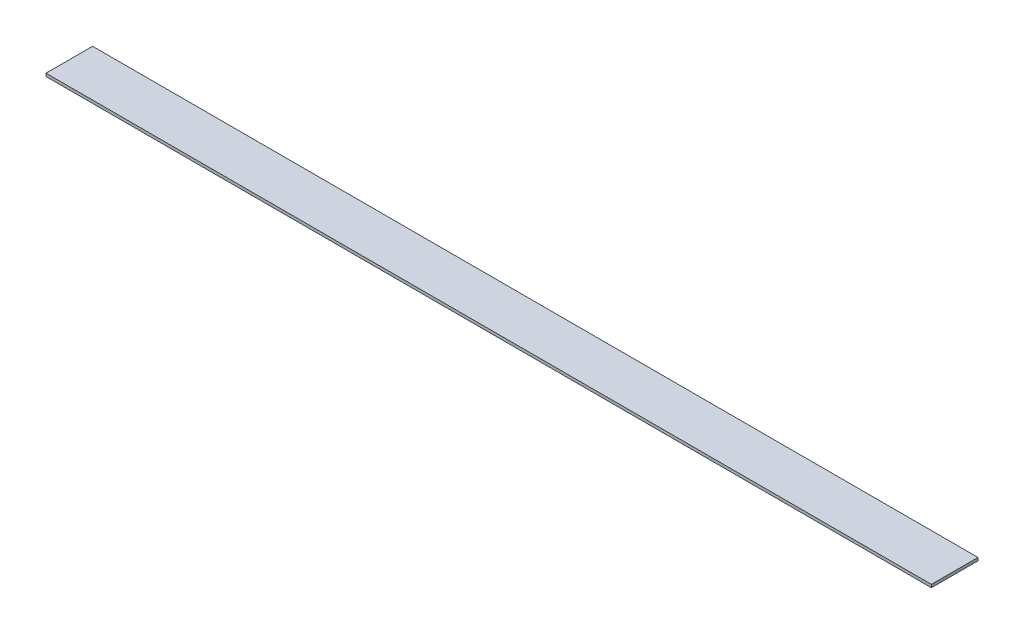
ISO-10303-21;
HEADER;
FILE_DESCRIPTION(('STEP AP214'),'2;1');
FILE_NAME('part.step','',(''),(''),'','','');
FILE_SCHEMA(('AUTOMOTIVE_DESIGN { 1 0 10303 214 1 1 1 1 }'));
ENDSEC;
DATA;
#1=APPLICATION_CONTEXT('core data for automotive mechanical design processes');
#2=APPLICATION_PROTOCOL_DEFINITION('international standard','automotive_design',2000,#1);
#3=PRODUCT_CONTEXT('',#1,'mechanical');
#4=PRODUCT('Part','Part','',(#3));
#5=PRODUCT_RELATED_PRODUCT_CATEGORY('part','',(#4));
#6=PRODUCT_DEFINITION_FORMATION('','',#4);
#7=PRODUCT_DEFINITION_CONTEXT('part definition',#1,'design');
#8=PRODUCT_DEFINITION('design','',#6,#7);
#9=PRODUCT_DEFINITION_SHAPE('','',#8);
#10=(LENGTH_UNIT() NAMED_UNIT(*) SI_UNIT(.MILLI.,.METRE.));
#11=(NAMED_UNIT(*) PLANE_ANGLE_UNIT() SI_UNIT($,.RADIAN.));
#12=(NAMED_UNIT(*) SI_UNIT($,.STERADIAN.) SOLID_ANGLE_UNIT());
#13=UNCERTAINTY_MEASURE_WITH_UNIT(LENGTH_MEASURE(1.E-05),#10,'distance_accuracy_value','');
#14=(GEOMETRIC_REPRESENTATION_CONTEXT(3) GLOBAL_UNCERTAINTY_ASSIGNED_CONTEXT((#13)) GLOBAL_UNIT_ASSIGNED_CONTEXT((#10,
#11,#12)) REPRESENTATION_CONTEXT('',''));
#15=CARTESIAN_POINT('',(0.,0.,0.));
#16=DIRECTION('',(0.,0.,1.));
#17=DIRECTION('',(1.,0.,0.));
#18=AXIS2_PLACEMENT_3D('',#15,#16,#17);
#19=CARTESIAN_POINT('',(0.,1.5875,0.));
#20=DIRECTION('',(1.,0.,0.));
#21=DIRECTION('',(0.,0.,-1.));
#22=AXIS2_PLACEMENT_3D('',#19,#20,#21);
#23=PLANE('',#22);
#24=DIRECTION('',(0.,0.,1.));
#25=VECTOR('',#24,1.);
#26=CARTESIAN_POINT('',(0.,0.,0.));
#27=LINE('',#26,#25);
#28=CARTESIAN_POINT('',(0.,0.,-25.4));
#29=VERTEX_POINT('',#28);
#30=CARTESIAN_POINT('',(0.,0.,0.));
#31=VERTEX_POINT('',#30);
#32=EDGE_CURVE('E96',#29,#31,#27,.T.);
#33=ORIENTED_EDGE('',*,*,#32,.T.);
#34=DIRECTION('',(0.,-1.,0.));
#35=VECTOR('',#34,1.);
#36=CARTESIAN_POINT('',(0.,1.5875,0.));
#37=LINE('',#36,#35);
#38=CARTESIAN_POINT('',(0.,1.5875,0.));
#39=VERTEX_POINT('',#38);
#40=EDGE_CURVE('E11',#39,#31,#37,.T.);
#41=ORIENTED_EDGE('',*,*,#40,.F.);
#42=DIRECTION('',(0.,0.,1.));
#43=VECTOR('',#42,1.);
#44=CARTESIAN_POINT('',(0.,1.5875,0.));
#45=LINE('',#44,#43);
#46=CARTESIAN_POINT('',(0.,1.5875,-25.4));
#47=VERTEX_POINT('',#46);
#48=EDGE_CURVE('E84',#47,#39,#45,.T.);
#49=ORIENTED_EDGE('',*,*,#48,.F.);
#50=DIRECTION('',(0.,-1.,0.));
#51=VECTOR('',#50,1.);
#52=CARTESIAN_POINT('',(0.,1.5875,-25.4));
#53=LINE('',#52,#51);
#54=EDGE_CURVE('E92',#47,#29,#53,.T.);
#55=ORIENTED_EDGE('',*,*,#54,.T.);
#56=EDGE_LOOP('',(#33,#41,#49,#55));
#57=FACE_BOUND('',#56,.T.);
#58=ADVANCED_FACE('F33',(#57),#23,.F.);
#59=CARTESIAN_POINT('',(0.,1.5875,0.));
#60=DIRECTION('',(0.,0.,-1.));
#61=DIRECTION('',(-1.,0.,0.));
#62=AXIS2_PLACEMENT_3D('',#59,#60,#61);
#63=PLANE('',#62);
#64=DIRECTION('',(1.,0.,0.));
#65=VECTOR('',#64,1.);
#66=CARTESIAN_POINT('',(0.,0.,0.));
#67=LINE('',#66,#65);
#68=CARTESIAN_POINT('',(482.6,0.,0.));
#69=VERTEX_POINT('',#68);
#70=EDGE_CURVE('E88',#31,#69,#67,.T.);
#71=ORIENTED_EDGE('',*,*,#70,.T.);
#72=DIRECTION('',(0.,-1.,0.));
#73=VECTOR('',#72,1.);
#74=CARTESIAN_POINT('',(482.6,1.5875,0.));
#75=LINE('',#74,#73);
#76=CARTESIAN_POINT('',(482.6,1.5875,0.));
#77=VERTEX_POINT('',#76);
#78=EDGE_CURVE('E41',#77,#69,#75,.T.);
#79=ORIENTED_EDGE('',*,*,#78,.F.);
#80=DIRECTION('',(1.,0.,0.));
#81=VECTOR('',#80,1.);
#82=CARTESIAN_POINT('',(0.,1.5875,0.));
#83=LINE('',#82,#81);
#84=EDGE_CURVE('E79',#39,#77,#83,.T.);
#85=ORIENTED_EDGE('',*,*,#84,.F.);
#86=ORIENTED_EDGE('',*,*,#40,.T.);
#87=EDGE_LOOP('',(#71,#79,#85,#86));
#88=FACE_BOUND('',#87,.T.);
#89=ADVANCED_FACE('F87',(#88),#63,.F.);
#90=CARTESIAN_POINT('',(482.6,1.5875,0.));
#91=DIRECTION('',(-1.,0.,0.));
#92=DIRECTION('',(0.,0.,1.));
#93=AXIS2_PLACEMENT_3D('',#90,#91,#92);
#94=PLANE('',#93);
#95=DIRECTION('',(0.,0.,-1.));
#96=VECTOR('',#95,1.);
#97=CARTESIAN_POINT('',(482.6,0.,0.));
#98=LINE('',#97,#96);
#99=CARTESIAN_POINT('',(482.6,0.,-25.4));
#100=VERTEX_POINT('',#99);
#101=EDGE_CURVE('E66',#69,#100,#98,.T.);
#102=ORIENTED_EDGE('',*,*,#101,.T.);
#103=DIRECTION('',(0.,-1.,0.));
#104=VECTOR('',#103,1.);
#105=CARTESIAN_POINT('',(482.6,1.5875,-25.4));
#106=LINE('',#105,#104);
#107=CARTESIAN_POINT('',(482.6,1.5875,-25.4));
#108=VERTEX_POINT('',#107);
#109=EDGE_CURVE('E89',#108,#100,#106,.T.);
#110=ORIENTED_EDGE('',*,*,#109,.F.);
#111=DIRECTION('',(0.,0.,-1.));
#112=VECTOR('',#111,1.);
#113=CARTESIAN_POINT('',(482.6,1.5875,0.));
#114=LINE('',#113,#112);
#115=EDGE_CURVE('E82',#77,#108,#114,.T.);
#116=ORIENTED_EDGE('',*,*,#115,.F.);
#117=ORIENTED_EDGE('',*,*,#78,.T.);
#118=EDGE_LOOP('',(#102,#110,#116,#117));
#119=FACE_BOUND('',#118,.T.);
#120=ADVANCED_FACE('F90',(#119),#94,.F.);
#121=CARTESIAN_POINT('',(0.,1.5875,-25.4));
#122=DIRECTION('',(0.,0.,1.));
#123=DIRECTION('',(1.,0.,0.));
#124=AXIS2_PLACEMENT_3D('',#121,#122,#123);
#125=PLANE('',#124);
#126=DIRECTION('',(-1.,0.,0.));
#127=VECTOR('',#126,1.);
#128=CARTESIAN_POINT('',(0.,0.,-25.4));
#129=LINE('',#128,#127);
#130=EDGE_CURVE('E72',#100,#29,#129,.T.);
#131=ORIENTED_EDGE('',*,*,#130,.T.);
#132=ORIENTED_EDGE('',*,*,#54,.F.);
#133=DIRECTION('',(-1.,0.,0.));
#134=VECTOR('',#133,1.);
#135=CARTESIAN_POINT('',(0.,1.5875,-25.4));
#136=LINE('',#135,#134);
#137=EDGE_CURVE('E49',#108,#47,#136,.T.);
#138=ORIENTED_EDGE('',*,*,#137,.F.);
#139=ORIENTED_EDGE('',*,*,#109,.T.);
#140=EDGE_LOOP('',(#131,#132,#138,#139));
#141=FACE_BOUND('',#140,.T.);
#142=ADVANCED_FACE('F103',(#141),#125,.F.);
#143=CARTESIAN_POINT('',(0.,1.5875,0.));
#144=DIRECTION('',(0.,-1.,0.));
#145=DIRECTION('',(0.,0.,-1.));
#146=AXIS2_PLACEMENT_3D('',#143,#144,#145);
#147=PLANE('',#146);
#148=ORIENTED_EDGE('',*,*,#48,.T.);
#149=ORIENTED_EDGE('',*,*,#84,.T.);
#150=ORIENTED_EDGE('',*,*,#115,.T.);
#151=ORIENTED_EDGE('',*,*,#137,.T.);
#152=EDGE_LOOP('',(#148,#149,#150,#151));
#153=FACE_BOUND('',#152,.T.);
#154=ADVANCED_FACE('F80',(#153),#147,.F.);
#155=CARTESIAN_POINT('',(0.,0.,0.));
#156=DIRECTION('',(0.,-1.,0.));
#157=DIRECTION('',(0.,0.,-1.));
#158=AXIS2_PLACEMENT_3D('',#155,#156,#157);
#159=PLANE('',#158);
#160=ORIENTED_EDGE('',*,*,#32,.F.);
#161=ORIENTED_EDGE('',*,*,#130,.F.);
#162=ORIENTED_EDGE('',*,*,#101,.F.);
#163=ORIENTED_EDGE('',*,*,#70,.F.);
#164=EDGE_LOOP('',(#160,#161,#162,#163));
#165=FACE_BOUND('',#164,.T.);
#166=ADVANCED_FACE('F106',(#165),#159,.T.);
#167=CLOSED_SHELL('',(#58,#89,#120,#142,#154,#166));
#168=MANIFOLD_SOLID_BREP('B2',#167);
#169=ADVANCED_BREP_SHAPE_REPRESENTATION('',(#18,#168),#14);
#170=SHAPE_DEFINITION_REPRESENTATION(#9,#169);
ENDSEC;
END-ISO-10303-21;
